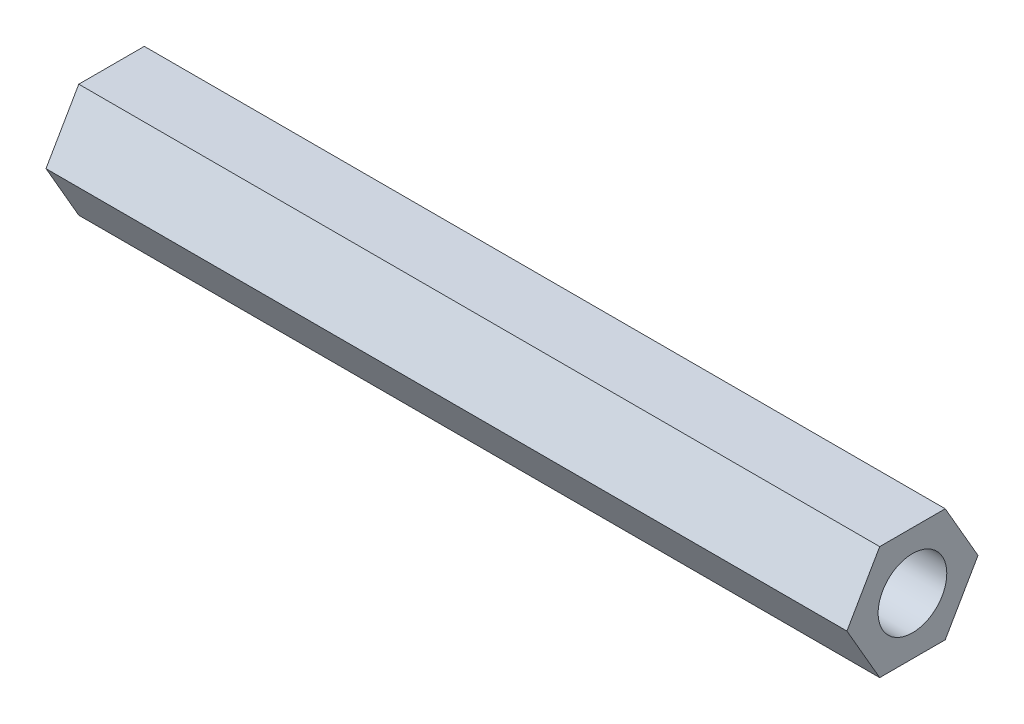
ISO-10303-21;
HEADER;
FILE_DESCRIPTION(('STEP AP214'),'2;1');
FILE_NAME('part.step','',(''),(''),'','','');
FILE_SCHEMA(('AUTOMOTIVE_DESIGN { 1 0 10303 214 1 1 1 1 }'));
ENDSEC;
DATA;
#1=APPLICATION_CONTEXT('core data for automotive mechanical design processes');
#2=APPLICATION_PROTOCOL_DEFINITION('international standard','automotive_design',2000,#1);
#3=PRODUCT_CONTEXT('',#1,'mechanical');
#4=PRODUCT('Part','Part','',(#3));
#5=PRODUCT_RELATED_PRODUCT_CATEGORY('part','',(#4));
#6=PRODUCT_DEFINITION_FORMATION('','',#4);
#7=PRODUCT_DEFINITION_CONTEXT('part definition',#1,'design');
#8=PRODUCT_DEFINITION('design','',#6,#7);
#9=PRODUCT_DEFINITION_SHAPE('','',#8);
#10=(LENGTH_UNIT() NAMED_UNIT(*) SI_UNIT(.MILLI.,.METRE.));
#11=(NAMED_UNIT(*) PLANE_ANGLE_UNIT() SI_UNIT($,.RADIAN.));
#12=(NAMED_UNIT(*) SI_UNIT($,.STERADIAN.) SOLID_ANGLE_UNIT());
#13=UNCERTAINTY_MEASURE_WITH_UNIT(LENGTH_MEASURE(1.E-05),#10,'distance_accuracy_value','');
#14=(GEOMETRIC_REPRESENTATION_CONTEXT(3) GLOBAL_UNCERTAINTY_ASSIGNED_CONTEXT((#13)) GLOBAL_UNIT_ASSIGNED_CONTEXT((#10,
#11,#12)) REPRESENTATION_CONTEXT('',''));
#15=CARTESIAN_POINT('',(0.,0.,0.));
#16=DIRECTION('',(0.,0.,1.));
#17=DIRECTION('',(1.,0.,0.));
#18=AXIS2_PLACEMENT_3D('',#15,#16,#17);
#19=CARTESIAN_POINT('',(111.125,0.,-9.09211203919823));
#20=DIRECTION('',(0.,-0.5,-0.866025403784438));
#21=DIRECTION('',(0.,0.866025403784439,-0.5));
#22=AXIS2_PLACEMENT_3D('',#19,#20,#21);
#23=PLANE('',#22);
#24=DIRECTION('',(0.,-0.866025403784438,0.5));
#25=VECTOR('',#24,1.);
#26=CARTESIAN_POINT('',(0.,0.,-9.09211203919823));
#27=LINE('',#26,#25);
#28=CARTESIAN_POINT('',(0.,0.,-9.09211203919823));
#29=VERTEX_POINT('',#28);
#30=CARTESIAN_POINT('',(0.,-7.874,-4.54605601959912));
#31=VERTEX_POINT('',#30);
#32=EDGE_CURVE('E118',#29,#31,#27,.T.);
#33=ORIENTED_EDGE('',*,*,#32,.F.);
#34=DIRECTION('',(-1.,0.,0.));
#35=VECTOR('',#34,1.);
#36=CARTESIAN_POINT('',(111.125,0.,-9.09211203919823));
#37=LINE('',#36,#35);
#38=CARTESIAN_POINT('',(111.125,0.,-9.09211203919823));
#39=VERTEX_POINT('',#38);
#40=EDGE_CURVE('E11',#39,#29,#37,.T.);
#41=ORIENTED_EDGE('',*,*,#40,.F.);
#42=DIRECTION('',(0.,-0.866025403784438,0.5));
#43=VECTOR('',#42,1.);
#44=CARTESIAN_POINT('',(111.125,0.,-9.09211203919823));
#45=LINE('',#44,#43);
#46=CARTESIAN_POINT('',(111.125,-7.874,-4.54605601959912));
#47=VERTEX_POINT('',#46);
#48=EDGE_CURVE('E133',#39,#47,#45,.T.);
#49=ORIENTED_EDGE('',*,*,#48,.T.);
#50=DIRECTION('',(-1.,0.,0.));
#51=VECTOR('',#50,1.);
#52=CARTESIAN_POINT('',(111.125,-7.874,-4.54605601959912));
#53=LINE('',#52,#51);
#54=EDGE_CURVE('E36',#47,#31,#53,.T.);
#55=ORIENTED_EDGE('',*,*,#54,.T.);
#56=EDGE_LOOP('',(#33,#41,#49,#55));
#57=FACE_BOUND('',#56,.T.);
#58=ADVANCED_FACE('F33',(#57),#23,.T.);
#59=CARTESIAN_POINT('',(111.125,7.874,-4.54605601959911));
#60=DIRECTION('',(0.,0.5,-0.866025403784438));
#61=DIRECTION('',(0.,0.866025403784439,0.5));
#62=AXIS2_PLACEMENT_3D('',#59,#60,#61);
#63=PLANE('',#62);
#64=DIRECTION('',(0.,-0.866025403784439,-0.5));
#65=VECTOR('',#64,1.);
#66=CARTESIAN_POINT('',(0.,7.874,-4.54605601959911));
#67=LINE('',#66,#65);
#68=CARTESIAN_POINT('',(0.,7.874,-4.54605601959911));
#69=VERTEX_POINT('',#68);
#70=EDGE_CURVE('E131',#69,#29,#67,.T.);
#71=ORIENTED_EDGE('',*,*,#70,.F.);
#72=DIRECTION('',(-1.,0.,0.));
#73=VECTOR('',#72,1.);
#74=CARTESIAN_POINT('',(111.125,7.874,-4.54605601959911));
#75=LINE('',#74,#73);
#76=CARTESIAN_POINT('',(111.125,7.874,-4.54605601959911));
#77=VERTEX_POINT('',#76);
#78=EDGE_CURVE('E42',#77,#69,#75,.T.);
#79=ORIENTED_EDGE('',*,*,#78,.F.);
#80=DIRECTION('',(0.,-0.866025403784439,-0.5));
#81=VECTOR('',#80,1.);
#82=CARTESIAN_POINT('',(111.125,7.874,-4.54605601959911));
#83=LINE('',#82,#81);
#84=EDGE_CURVE('E108',#77,#39,#83,.T.);
#85=ORIENTED_EDGE('',*,*,#84,.T.);
#86=ORIENTED_EDGE('',*,*,#40,.T.);
#87=EDGE_LOOP('',(#71,#79,#85,#86));
#88=FACE_BOUND('',#87,.T.);
#89=ADVANCED_FACE('F141',(#88),#63,.T.);
#90=CARTESIAN_POINT('',(111.125,7.874,4.54605601959912));
#91=DIRECTION('',(0.,1.,0.));
#92=DIRECTION('',(0.,0.,1.));
#93=AXIS2_PLACEMENT_3D('',#90,#91,#92);
#94=PLANE('',#93);
#95=DIRECTION('',(0.,0.,-1.));
#96=VECTOR('',#95,1.);
#97=CARTESIAN_POINT('',(0.,7.874,4.54605601959912));
#98=LINE('',#97,#96);
#99=CARTESIAN_POINT('',(0.,7.874,4.54605601959912));
#100=VERTEX_POINT('',#99);
#101=EDGE_CURVE('E95',#100,#69,#98,.T.);
#102=ORIENTED_EDGE('',*,*,#101,.F.);
#103=DIRECTION('',(-1.,0.,0.));
#104=VECTOR('',#103,1.);
#105=CARTESIAN_POINT('',(111.125,7.874,4.54605601959912));
#106=LINE('',#105,#104);
#107=CARTESIAN_POINT('',(111.125,7.874,4.54605601959912));
#108=VERTEX_POINT('',#107);
#109=EDGE_CURVE('E90',#108,#100,#106,.T.);
#110=ORIENTED_EDGE('',*,*,#109,.F.);
#111=DIRECTION('',(0.,0.,-1.));
#112=VECTOR('',#111,1.);
#113=CARTESIAN_POINT('',(111.125,7.874,4.54605601959912));
#114=LINE('',#113,#112);
#115=EDGE_CURVE('E93',#108,#77,#114,.T.);
#116=ORIENTED_EDGE('',*,*,#115,.T.);
#117=ORIENTED_EDGE('',*,*,#78,.T.);
#118=EDGE_LOOP('',(#102,#110,#116,#117));
#119=FACE_BOUND('',#118,.T.);
#120=ADVANCED_FACE('F92',(#119),#94,.T.);
#121=CARTESIAN_POINT('',(111.125,0.,9.09211203919823));
#122=DIRECTION('',(0.,0.5,0.866025403784439));
#123=DIRECTION('',(0.,-0.866025403784439,0.5));
#124=AXIS2_PLACEMENT_3D('',#121,#122,#123);
#125=PLANE('',#124);
#126=DIRECTION('',(0.,0.866025403784439,-0.5));
#127=VECTOR('',#126,1.);
#128=CARTESIAN_POINT('',(0.,0.,9.09211203919823));
#129=LINE('',#128,#127);
#130=CARTESIAN_POINT('',(0.,0.,9.09211203919823));
#131=VERTEX_POINT('',#130);
#132=EDGE_CURVE('E128',#131,#100,#129,.T.);
#133=ORIENTED_EDGE('',*,*,#132,.F.);
#134=DIRECTION('',(-1.,0.,0.));
#135=VECTOR('',#134,1.);
#136=CARTESIAN_POINT('',(111.125,0.,9.09211203919823));
#137=LINE('',#136,#135);
#138=CARTESIAN_POINT('',(111.125,0.,9.09211203919823));
#139=VERTEX_POINT('',#138);
#140=EDGE_CURVE('E100',#139,#131,#137,.T.);
#141=ORIENTED_EDGE('',*,*,#140,.F.);
#142=DIRECTION('',(0.,0.866025403784439,-0.5));
#143=VECTOR('',#142,1.);
#144=CARTESIAN_POINT('',(111.125,0.,9.09211203919823));
#145=LINE('',#144,#143);
#146=EDGE_CURVE('E106',#139,#108,#145,.T.);
#147=ORIENTED_EDGE('',*,*,#146,.T.);
#148=ORIENTED_EDGE('',*,*,#109,.T.);
#149=EDGE_LOOP('',(#133,#141,#147,#148));
#150=FACE_BOUND('',#149,.T.);
#151=ADVANCED_FACE('F110',(#150),#125,.T.);
#152=CARTESIAN_POINT('',(111.125,-7.874,4.54605601959911));
#153=DIRECTION('',(0.,-0.5,0.866025403784439));
#154=DIRECTION('',(0.,-0.866025403784439,-0.5));
#155=AXIS2_PLACEMENT_3D('',#152,#153,#154);
#156=PLANE('',#155);
#157=DIRECTION('',(0.,0.866025403784439,0.5));
#158=VECTOR('',#157,1.);
#159=CARTESIAN_POINT('',(0.,-7.874,4.54605601959911));
#160=LINE('',#159,#158);
#161=CARTESIAN_POINT('',(0.,-7.874,4.54605601959911));
#162=VERTEX_POINT('',#161);
#163=EDGE_CURVE('E125',#162,#131,#160,.T.);
#164=ORIENTED_EDGE('',*,*,#163,.F.);
#165=DIRECTION('',(-1.,0.,0.));
#166=VECTOR('',#165,1.);
#167=CARTESIAN_POINT('',(111.125,-7.874,4.54605601959911));
#168=LINE('',#167,#166);
#169=CARTESIAN_POINT('',(111.125,-7.874,4.54605601959911));
#170=VERTEX_POINT('',#169);
#171=EDGE_CURVE('E136',#170,#162,#168,.T.);
#172=ORIENTED_EDGE('',*,*,#171,.F.);
#173=DIRECTION('',(0.,0.866025403784439,0.5));
#174=VECTOR('',#173,1.);
#175=CARTESIAN_POINT('',(111.125,-7.874,4.54605601959911));
#176=LINE('',#175,#174);
#177=EDGE_CURVE('E111',#170,#139,#176,.T.);
#178=ORIENTED_EDGE('',*,*,#177,.T.);
#179=ORIENTED_EDGE('',*,*,#140,.T.);
#180=EDGE_LOOP('',(#164,#172,#178,#179));
#181=FACE_BOUND('',#180,.T.);
#182=ADVANCED_FACE('F154',(#181),#156,.T.);
#183=CARTESIAN_POINT('',(111.125,-7.874,-4.54605601959912));
#184=DIRECTION('',(0.,-1.,0.));
#185=DIRECTION('',(0.,0.,-1.));
#186=AXIS2_PLACEMENT_3D('',#183,#184,#185);
#187=PLANE('',#186);
#188=DIRECTION('',(0.,0.,1.));
#189=VECTOR('',#188,1.);
#190=CARTESIAN_POINT('',(0.,-7.874,-4.54605601959912));
#191=LINE('',#190,#189);
#192=EDGE_CURVE('E121',#31,#162,#191,.T.);
#193=ORIENTED_EDGE('',*,*,#192,.F.);
#194=ORIENTED_EDGE('',*,*,#54,.F.);
#195=DIRECTION('',(0.,0.,1.));
#196=VECTOR('',#195,1.);
#197=CARTESIAN_POINT('',(111.125,-7.874,-4.54605601959912));
#198=LINE('',#197,#196);
#199=EDGE_CURVE('E113',#47,#170,#198,.T.);
#200=ORIENTED_EDGE('',*,*,#199,.T.);
#201=ORIENTED_EDGE('',*,*,#171,.T.);
#202=EDGE_LOOP('',(#193,#194,#200,#201));
#203=FACE_BOUND('',#202,.T.);
#204=ADVANCED_FACE('F138',(#203),#187,.T.);
#205=CARTESIAN_POINT('',(111.125,0.,0.));
#206=DIRECTION('',(-1.,0.,0.));
#207=DIRECTION('',(0.,0.,1.));
#208=AXIS2_PLACEMENT_3D('',#205,#206,#207);
#209=PLANE('',#208);
#210=CARTESIAN_POINT('',(111.125,0.,0.));
#211=DIRECTION('',(-1.,0.,0.));
#212=DIRECTION('',(0.,0.,-1.));
#213=AXIS2_PLACEMENT_3D('',#210,#211,#212);
#214=CIRCLE('',#213,4.7625);
#215=CARTESIAN_POINT('',(111.125,0.,-4.7625));
#216=VERTEX_POINT('',#215);
#217=EDGE_CURVE('E122',#216,#216,#214,.T.);
#218=ORIENTED_EDGE('',*,*,#217,.T.);
#219=EDGE_LOOP('',(#218));
#220=FACE_BOUND('',#219,.T.);
#221=ORIENTED_EDGE('',*,*,#48,.F.);
#222=ORIENTED_EDGE('',*,*,#84,.F.);
#223=ORIENTED_EDGE('',*,*,#115,.F.);
#224=ORIENTED_EDGE('',*,*,#146,.F.);
#225=ORIENTED_EDGE('',*,*,#177,.F.);
#226=ORIENTED_EDGE('',*,*,#199,.F.);
#227=EDGE_LOOP('',(#221,#222,#223,#224,#225,#226));
#228=FACE_BOUND('',#227,.T.);
#229=ADVANCED_FACE('F104',(#220,#228),#209,.F.);
#230=CARTESIAN_POINT('',(0.,0.,0.));
#231=DIRECTION('',(-1.,0.,0.));
#232=DIRECTION('',(0.,0.,1.));
#233=AXIS2_PLACEMENT_3D('',#230,#231,#232);
#234=PLANE('',#233);
#235=CARTESIAN_POINT('',(0.,0.,0.));
#236=DIRECTION('',(-1.,0.,0.));
#237=DIRECTION('',(0.,0.,-1.));
#238=AXIS2_PLACEMENT_3D('',#235,#236,#237);
#239=CIRCLE('',#238,4.7625);
#240=CARTESIAN_POINT('',(0.,0.,-4.7625));
#241=VERTEX_POINT('',#240);
#242=EDGE_CURVE('E177',#241,#241,#239,.T.);
#243=ORIENTED_EDGE('',*,*,#242,.F.);
#244=EDGE_LOOP('',(#243));
#245=FACE_BOUND('',#244,.T.);
#246=ORIENTED_EDGE('',*,*,#32,.T.);
#247=ORIENTED_EDGE('',*,*,#192,.T.);
#248=ORIENTED_EDGE('',*,*,#163,.T.);
#249=ORIENTED_EDGE('',*,*,#132,.T.);
#250=ORIENTED_EDGE('',*,*,#101,.T.);
#251=ORIENTED_EDGE('',*,*,#70,.T.);
#252=EDGE_LOOP('',(#246,#247,#248,#249,#250,#251));
#253=FACE_BOUND('',#252,.T.);
#254=ADVANCED_FACE('F140',(#245,#253),#234,.T.);
#255=CARTESIAN_POINT('',(111.125,0.,0.));
#256=DIRECTION('',(-1.,0.,0.));
#257=DIRECTION('',(0.,0.,1.));
#258=AXIS2_PLACEMENT_3D('',#255,#256,#257);
#259=CYLINDRICAL_SURFACE('',#258,4.7625);
#260=ORIENTED_EDGE('',*,*,#217,.F.);
#261=EDGE_LOOP('',(#260));
#262=FACE_BOUND('',#261,.T.);
#263=ORIENTED_EDGE('',*,*,#242,.T.);
#264=EDGE_LOOP('',(#263));
#265=FACE_BOUND('',#264,.T.);
#266=ADVANCED_FACE('F165',(#262,#265),#259,.F.);
#267=CLOSED_SHELL('',(#58,#89,#120,#151,#182,#204,#229,#254,#266));
#268=MANIFOLD_SOLID_BREP('B2',#267);
#269=ADVANCED_BREP_SHAPE_REPRESENTATION('',(#18,#268),#14);
#270=SHAPE_DEFINITION_REPRESENTATION(#9,#269);
ENDSEC;
END-ISO-10303-21;
